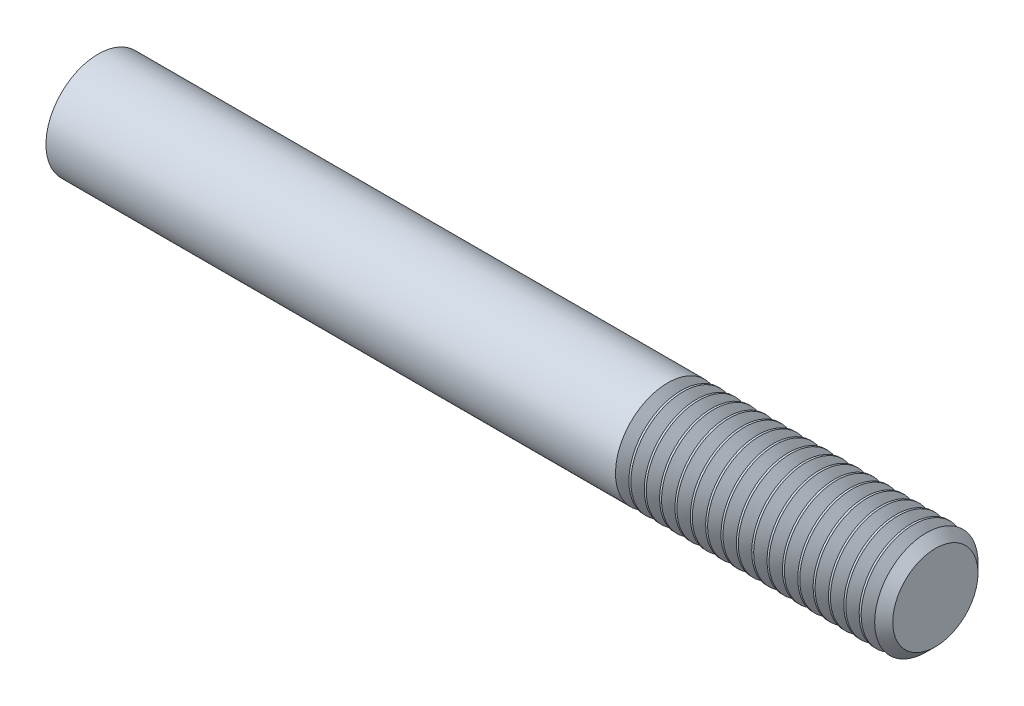
ISO-10303-21;
HEADER;
FILE_DESCRIPTION(('STEP AP214'),'2;1');
FILE_NAME('part.step','',(''),(''),'','','');
FILE_SCHEMA(('AUTOMOTIVE_DESIGN { 1 0 10303 214 1 1 1 1 }'));
ENDSEC;
DATA;
#1=APPLICATION_CONTEXT('core data for automotive mechanical design processes');
#2=APPLICATION_PROTOCOL_DEFINITION('international standard','automotive_design',2000,#1);
#3=PRODUCT_CONTEXT('',#1,'mechanical');
#4=PRODUCT('Part','Part','',(#3));
#5=PRODUCT_RELATED_PRODUCT_CATEGORY('part','',(#4));
#6=PRODUCT_DEFINITION_FORMATION('','',#4);
#7=PRODUCT_DEFINITION_CONTEXT('part definition',#1,'design');
#8=PRODUCT_DEFINITION('design','',#6,#7);
#9=PRODUCT_DEFINITION_SHAPE('','',#8);
#10=(LENGTH_UNIT() NAMED_UNIT(*) SI_UNIT(.MILLI.,.METRE.));
#11=(NAMED_UNIT(*) PLANE_ANGLE_UNIT() SI_UNIT($,.RADIAN.));
#12=(NAMED_UNIT(*) SI_UNIT($,.STERADIAN.) SOLID_ANGLE_UNIT());
#13=UNCERTAINTY_MEASURE_WITH_UNIT(LENGTH_MEASURE(1.E-05),#10,'distance_accuracy_value','');
#14=(GEOMETRIC_REPRESENTATION_CONTEXT(3) GLOBAL_UNCERTAINTY_ASSIGNED_CONTEXT((#13)) GLOBAL_UNIT_ASSIGNED_CONTEXT((#10,
#11,#12)) REPRESENTATION_CONTEXT('',''));
#15=CARTESIAN_POINT('',(0.,0.,0.));
#16=DIRECTION('',(0.,0.,1.));
#17=DIRECTION('',(1.,0.,0.));
#18=AXIS2_PLACEMENT_3D('',#15,#16,#17);
#19=CARTESIAN_POINT('',(0.,0.,0.));
#20=DIRECTION('',(-1.,0.,0.));
#21=DIRECTION('',(0.,0.,1.));
#22=AXIS2_PLACEMENT_3D('',#19,#20,#21);
#23=CYLINDRICAL_SURFACE('',#22,6.35);
#24=CARTESIAN_POINT('',(71.1570816254734,0.,0.));
#25=DIRECTION('',(-1.,0.,0.));
#26=DIRECTION('',(0.,-1.,0.));
#27=AXIS2_PLACEMENT_3D('',#24,#25,#26);
#28=CIRCLE('',#27,6.35000000000001);
#29=CARTESIAN_POINT('',(71.1570816254734,-6.35,0.));
#30=VERTEX_POINT('',#29);
#31=EDGE_CURVE('E217',#30,#30,#28,.T.);
#32=ORIENTED_EDGE('',*,*,#31,.T.);
#33=EDGE_LOOP('',(#32));
#34=FACE_BOUND('',#33,.T.);
#35=CARTESIAN_POINT('',(70.9185654333501,0.,0.));
#36=DIRECTION('',(-1.,0.,0.));
#37=DIRECTION('',(0.,-1.,0.));
#38=AXIS2_PLACEMENT_3D('',#35,#36,#37);
#39=CIRCLE('',#38,6.35000000000001);
#40=CARTESIAN_POINT('',(70.9185654333501,-6.35,0.));
#41=VERTEX_POINT('',#40);
#42=EDGE_CURVE('E229',#41,#41,#39,.T.);
#43=ORIENTED_EDGE('',*,*,#42,.F.);
#44=EDGE_LOOP('',(#43));
#45=FACE_BOUND('',#44,.T.);
#46=ADVANCED_FACE('F36',(#34,#45),#23,.T.);
#47=CARTESIAN_POINT('',(70.9185654333501,0.,0.));
#48=DIRECTION('',(1.,0.,0.));
#49=DIRECTION('',(0.,1.,0.));
#50=AXIS2_PLACEMENT_3D('',#47,#48,#49);
#51=CONICAL_SURFACE('',#50,6.35000000000001,0.959931088596887);
#52=CARTESIAN_POINT('',(70.104,0.,0.));
#53=DIRECTION('',(-1.,0.,0.));
#54=DIRECTION('',(0.,-1.,0.));
#55=AXIS2_PLACEMENT_3D('',#52,#53,#54);
#56=CIRCLE('',#55,5.18668000000001);
#57=CARTESIAN_POINT('',(70.104,-5.18668,0.));
#58=VERTEX_POINT('',#57);
#59=EDGE_CURVE('E223',#58,#58,#56,.T.);
#60=ORIENTED_EDGE('',*,*,#59,.F.);
#61=EDGE_LOOP('',(#60));
#62=FACE_BOUND('',#61,.T.);
#63=ORIENTED_EDGE('',*,*,#42,.T.);
#64=EDGE_LOOP('',(#63));
#65=FACE_BOUND('',#64,.T.);
#66=ADVANCED_FACE('F252',(#62,#65),#51,.T.);
#67=CARTESIAN_POINT('',(70.104,0.,0.));
#68=DIRECTION('',(-1.,0.,0.));
#69=DIRECTION('',(0.,-1.,0.));
#70=AXIS2_PLACEMENT_3D('',#67,#68,#69);
#71=CONICAL_SURFACE('',#70,5.18668000000001,0.959931088596879);
#72=CARTESIAN_POINT('',(69.2894345666499,0.,0.));
#73=DIRECTION('',(-1.,0.,0.));
#74=DIRECTION('',(0.,-1.,0.));
#75=AXIS2_PLACEMENT_3D('',#72,#73,#74);
#76=CIRCLE('',#75,6.35000000000001);
#77=CARTESIAN_POINT('',(69.2894345666499,-6.35,0.));
#78=VERTEX_POINT('',#77);
#79=EDGE_CURVE('E226',#78,#78,#76,.T.);
#80=ORIENTED_EDGE('',*,*,#79,.F.);
#81=EDGE_LOOP('',(#80));
#82=FACE_BOUND('',#81,.T.);
#83=ORIENTED_EDGE('',*,*,#59,.T.);
#84=EDGE_LOOP('',(#83));
#85=FACE_BOUND('',#84,.T.);
#86=ADVANCED_FACE('F259',(#82,#85),#71,.T.);
#87=CARTESIAN_POINT('',(0.,7.33234841870826,0.));
#88=DIRECTION('',(1.,0.,0.));
#89=DIRECTION('',(0.,0.,-1.));
#90=AXIS2_PLACEMENT_3D('',#87,#88,#89);
#91=PLANE('',#90);
#92=DIRECTION('',(0.,0.,-1.));
#93=VECTOR('',#92,1.);
#94=CARTESIAN_POINT('',(0.,2.54,-1.905));
#95=LINE('',#94,#93);
#96=CARTESIAN_POINT('',(0.,2.54,1.905));
#97=VERTEX_POINT('',#96);
#98=CARTESIAN_POINT('',(0.,2.54,-1.905));
#99=VERTEX_POINT('',#98);
#100=EDGE_CURVE('E72',#97,#99,#95,.T.);
#101=ORIENTED_EDGE('',*,*,#100,.F.);
#102=CARTESIAN_POINT('',(0.,0.,0.));
#103=DIRECTION('',(-1.,0.,0.));
#104=DIRECTION('',(0.,0.,1.));
#105=AXIS2_PLACEMENT_3D('',#102,#103,#104);
#106=CIRCLE('',#105,3.175);
#107=EDGE_CURVE('E52',#99,#97,#106,.T.);
#108=ORIENTED_EDGE('',*,*,#107,.F.);
#109=EDGE_LOOP('',(#101,#108));
#110=FACE_BOUND('',#109,.T.);
#111=CARTESIAN_POINT('',(0.,0.,0.));
#112=DIRECTION('',(1.,0.,0.));
#113=DIRECTION('',(0.,0.,-1.));
#114=AXIS2_PLACEMENT_3D('',#111,#112,#113);
#115=CIRCLE('',#114,6.35);
#116=CARTESIAN_POINT('',(0.,0.,-6.35));
#117=VERTEX_POINT('',#116);
#118=EDGE_CURVE('E12',#117,#117,#115,.T.);
#119=ORIENTED_EDGE('',*,*,#118,.F.);
#120=EDGE_LOOP('',(#119));
#121=FACE_BOUND('',#120,.T.);
#122=ADVANCED_FACE('F38',(#110,#121),#91,.F.);
#123=ORIENTED_EDGE('',*,*,#79,.T.);
#124=EDGE_LOOP('',(#123));
#125=FACE_BOUND('',#124,.T.);
#126=ORIENTED_EDGE('',*,*,#118,.T.);
#127=EDGE_LOOP('',(#126));
#128=FACE_BOUND('',#127,.T.);
#129=ADVANCED_FACE('F254',(#125,#128),#23,.T.);
#130=CARTESIAN_POINT('',(72.7862124921736,0.,0.));
#131=DIRECTION('',(1.,0.,0.));
#132=DIRECTION('',(0.,1.,0.));
#133=AXIS2_PLACEMENT_3D('',#130,#131,#132);
#134=CONICAL_SURFACE('',#133,6.35000000000001,0.959931088596887);
#135=CARTESIAN_POINT('',(71.9716470588235,0.,0.));
#136=DIRECTION('',(-1.,0.,0.));
#137=DIRECTION('',(0.,-1.,0.));
#138=AXIS2_PLACEMENT_3D('',#135,#136,#137);
#139=CIRCLE('',#138,5.18668000000001);
#140=CARTESIAN_POINT('',(71.9716470588235,-5.18668,0.));
#141=VERTEX_POINT('',#140);
#142=EDGE_CURVE('E214',#141,#141,#139,.T.);
#143=ORIENTED_EDGE('',*,*,#142,.F.);
#144=EDGE_LOOP('',(#143));
#145=FACE_BOUND('',#144,.T.);
#146=CARTESIAN_POINT('',(72.7862124921736,0.,0.));
#147=DIRECTION('',(-1.,0.,0.));
#148=DIRECTION('',(0.,-1.,0.));
#149=AXIS2_PLACEMENT_3D('',#146,#147,#148);
#150=CIRCLE('',#149,6.35000000000001);
#151=CARTESIAN_POINT('',(72.7862124921736,-6.35,0.));
#152=VERTEX_POINT('',#151);
#153=EDGE_CURVE('E220',#152,#152,#150,.T.);
#154=ORIENTED_EDGE('',*,*,#153,.T.);
#155=EDGE_LOOP('',(#154));
#156=FACE_BOUND('',#155,.T.);
#157=ADVANCED_FACE('F263',(#145,#156),#134,.T.);
#158=CARTESIAN_POINT('',(71.9716470588235,0.,0.));
#159=DIRECTION('',(-1.,0.,0.));
#160=DIRECTION('',(0.,-1.,0.));
#161=AXIS2_PLACEMENT_3D('',#158,#159,#160);
#162=CONICAL_SURFACE('',#161,5.18668000000001,0.959931088596879);
#163=ORIENTED_EDGE('',*,*,#31,.F.);
#164=EDGE_LOOP('',(#163));
#165=FACE_BOUND('',#164,.T.);
#166=ORIENTED_EDGE('',*,*,#142,.T.);
#167=EDGE_LOOP('',(#166));
#168=FACE_BOUND('',#167,.T.);
#169=ADVANCED_FACE('F268',(#165,#168),#162,.T.);
#170=CARTESIAN_POINT('',(73.0247286842969,0.,0.));
#171=DIRECTION('',(-1.,0.,0.));
#172=DIRECTION('',(0.,-1.,0.));
#173=AXIS2_PLACEMENT_3D('',#170,#171,#172);
#174=CIRCLE('',#173,6.35000000000001);
#175=CARTESIAN_POINT('',(73.0247286842969,-6.35,0.));
#176=VERTEX_POINT('',#175);
#177=EDGE_CURVE('E208',#176,#176,#174,.T.);
#178=ORIENTED_EDGE('',*,*,#177,.T.);
#179=EDGE_LOOP('',(#178));
#180=FACE_BOUND('',#179,.T.);
#181=ORIENTED_EDGE('',*,*,#153,.F.);
#182=EDGE_LOOP('',(#181));
#183=FACE_BOUND('',#182,.T.);
#184=ADVANCED_FACE('F255',(#180,#183),#23,.T.);
#185=CARTESIAN_POINT('',(74.6538595509972,0.,0.));
#186=DIRECTION('',(1.,0.,0.));
#187=DIRECTION('',(0.,1.,0.));
#188=AXIS2_PLACEMENT_3D('',#185,#186,#187);
#189=CONICAL_SURFACE('',#188,6.35000000000001,0.959931088596887);
#190=CARTESIAN_POINT('',(73.839294117647,0.,0.));
#191=DIRECTION('',(-1.,0.,0.));
#192=DIRECTION('',(0.,-1.,0.));
#193=AXIS2_PLACEMENT_3D('',#190,#191,#192);
#194=CIRCLE('',#193,5.18668000000001);
#195=CARTESIAN_POINT('',(73.839294117647,-5.18668,0.));
#196=VERTEX_POINT('',#195);
#197=EDGE_CURVE('E205',#196,#196,#194,.T.);
#198=ORIENTED_EDGE('',*,*,#197,.F.);
#199=EDGE_LOOP('',(#198));
#200=FACE_BOUND('',#199,.T.);
#201=CARTESIAN_POINT('',(74.6538595509972,0.,0.));
#202=DIRECTION('',(-1.,0.,0.));
#203=DIRECTION('',(0.,-1.,0.));
#204=AXIS2_PLACEMENT_3D('',#201,#202,#203);
#205=CIRCLE('',#204,6.35000000000001);
#206=CARTESIAN_POINT('',(74.6538595509972,-6.35,0.));
#207=VERTEX_POINT('',#206);
#208=EDGE_CURVE('E211',#207,#207,#205,.T.);
#209=ORIENTED_EDGE('',*,*,#208,.T.);
#210=EDGE_LOOP('',(#209));
#211=FACE_BOUND('',#210,.T.);
#212=ADVANCED_FACE('F267',(#200,#211),#189,.T.);
#213=CARTESIAN_POINT('',(73.839294117647,0.,0.));
#214=DIRECTION('',(-1.,0.,0.));
#215=DIRECTION('',(0.,-1.,0.));
#216=AXIS2_PLACEMENT_3D('',#213,#214,#215);
#217=CONICAL_SURFACE('',#216,5.18668000000001,0.959931088596879);
#218=ORIENTED_EDGE('',*,*,#177,.F.);
#219=EDGE_LOOP('',(#218));
#220=FACE_BOUND('',#219,.T.);
#221=ORIENTED_EDGE('',*,*,#197,.T.);
#222=EDGE_LOOP('',(#221));
#223=FACE_BOUND('',#222,.T.);
#224=ADVANCED_FACE('F275',(#220,#223),#217,.T.);
#225=CARTESIAN_POINT('',(74.8923757431205,0.,0.));
#226=DIRECTION('',(-1.,0.,0.));
#227=DIRECTION('',(0.,-1.,0.));
#228=AXIS2_PLACEMENT_3D('',#225,#226,#227);
#229=CIRCLE('',#228,6.35000000000001);
#230=CARTESIAN_POINT('',(74.8923757431205,-6.35,0.));
#231=VERTEX_POINT('',#230);
#232=EDGE_CURVE('E199',#231,#231,#229,.T.);
#233=ORIENTED_EDGE('',*,*,#232,.T.);
#234=EDGE_LOOP('',(#233));
#235=FACE_BOUND('',#234,.T.);
#236=ORIENTED_EDGE('',*,*,#208,.F.);
#237=EDGE_LOOP('',(#236));
#238=FACE_BOUND('',#237,.T.);
#239=ADVANCED_FACE('F270',(#235,#238),#23,.T.);
#240=CARTESIAN_POINT('',(76.5215066098207,0.,0.));
#241=DIRECTION('',(1.,0.,0.));
#242=DIRECTION('',(0.,1.,0.));
#243=AXIS2_PLACEMENT_3D('',#240,#241,#242);
#244=CONICAL_SURFACE('',#243,6.35000000000001,0.959931088596887);
#245=CARTESIAN_POINT('',(75.7069411764706,0.,0.));
#246=DIRECTION('',(-1.,0.,0.));
#247=DIRECTION('',(0.,-1.,0.));
#248=AXIS2_PLACEMENT_3D('',#245,#246,#247);
#249=CIRCLE('',#248,5.18668000000001);
#250=CARTESIAN_POINT('',(75.7069411764706,-5.18668,0.));
#251=VERTEX_POINT('',#250);
#252=EDGE_CURVE('E196',#251,#251,#249,.T.);
#253=ORIENTED_EDGE('',*,*,#252,.F.);
#254=EDGE_LOOP('',(#253));
#255=FACE_BOUND('',#254,.T.);
#256=CARTESIAN_POINT('',(76.5215066098207,0.,0.));
#257=DIRECTION('',(-1.,0.,0.));
#258=DIRECTION('',(0.,-1.,0.));
#259=AXIS2_PLACEMENT_3D('',#256,#257,#258);
#260=CIRCLE('',#259,6.35000000000001);
#261=CARTESIAN_POINT('',(76.5215066098207,-6.35,0.));
#262=VERTEX_POINT('',#261);
#263=EDGE_CURVE('E202',#262,#262,#260,.T.);
#264=ORIENTED_EDGE('',*,*,#263,.T.);
#265=EDGE_LOOP('',(#264));
#266=FACE_BOUND('',#265,.T.);
#267=ADVANCED_FACE('F282',(#255,#266),#244,.T.);
#268=CARTESIAN_POINT('',(75.7069411764706,0.,0.));
#269=DIRECTION('',(-1.,0.,0.));
#270=DIRECTION('',(0.,-1.,0.));
#271=AXIS2_PLACEMENT_3D('',#268,#269,#270);
#272=CONICAL_SURFACE('',#271,5.18668000000001,0.959931088596879);
#273=ORIENTED_EDGE('',*,*,#232,.F.);
#274=EDGE_LOOP('',(#273));
#275=FACE_BOUND('',#274,.T.);
#276=ORIENTED_EDGE('',*,*,#252,.T.);
#277=EDGE_LOOP('',(#276));
#278=FACE_BOUND('',#277,.T.);
#279=ADVANCED_FACE('F289',(#275,#278),#272,.T.);
#280=CARTESIAN_POINT('',(76.760022801944,0.,0.));
#281=DIRECTION('',(-1.,0.,0.));
#282=DIRECTION('',(0.,-1.,0.));
#283=AXIS2_PLACEMENT_3D('',#280,#281,#282);
#284=CIRCLE('',#283,6.35000000000001);
#285=CARTESIAN_POINT('',(76.760022801944,-6.35,0.));
#286=VERTEX_POINT('',#285);
#287=EDGE_CURVE('E190',#286,#286,#284,.T.);
#288=ORIENTED_EDGE('',*,*,#287,.T.);
#289=EDGE_LOOP('',(#288));
#290=FACE_BOUND('',#289,.T.);
#291=ORIENTED_EDGE('',*,*,#263,.F.);
#292=EDGE_LOOP('',(#291));
#293=FACE_BOUND('',#292,.T.);
#294=ADVANCED_FACE('F284',(#290,#293),#23,.T.);
#295=CARTESIAN_POINT('',(78.3891536686442,0.,0.));
#296=DIRECTION('',(1.,0.,0.));
#297=DIRECTION('',(0.,1.,0.));
#298=AXIS2_PLACEMENT_3D('',#295,#296,#297);
#299=CONICAL_SURFACE('',#298,6.35000000000001,0.959931088596887);
#300=CARTESIAN_POINT('',(77.5745882352941,0.,0.));
#301=DIRECTION('',(-1.,0.,0.));
#302=DIRECTION('',(0.,-1.,0.));
#303=AXIS2_PLACEMENT_3D('',#300,#301,#302);
#304=CIRCLE('',#303,5.18668000000001);
#305=CARTESIAN_POINT('',(77.5745882352941,-5.18668,0.));
#306=VERTEX_POINT('',#305);
#307=EDGE_CURVE('E187',#306,#306,#304,.T.);
#308=ORIENTED_EDGE('',*,*,#307,.F.);
#309=EDGE_LOOP('',(#308));
#310=FACE_BOUND('',#309,.T.);
#311=CARTESIAN_POINT('',(78.3891536686442,0.,0.));
#312=DIRECTION('',(-1.,0.,0.));
#313=DIRECTION('',(0.,-1.,0.));
#314=AXIS2_PLACEMENT_3D('',#311,#312,#313);
#315=CIRCLE('',#314,6.35000000000001);
#316=CARTESIAN_POINT('',(78.3891536686442,-6.35,0.));
#317=VERTEX_POINT('',#316);
#318=EDGE_CURVE('E193',#317,#317,#315,.T.);
#319=ORIENTED_EDGE('',*,*,#318,.T.);
#320=EDGE_LOOP('',(#319));
#321=FACE_BOUND('',#320,.T.);
#322=ADVANCED_FACE('F296',(#310,#321),#299,.T.);
#323=CARTESIAN_POINT('',(77.5745882352941,0.,0.));
#324=DIRECTION('',(-1.,0.,0.));
#325=DIRECTION('',(0.,-1.,0.));
#326=AXIS2_PLACEMENT_3D('',#323,#324,#325);
#327=CONICAL_SURFACE('',#326,5.18668000000001,0.959931088596879);
#328=ORIENTED_EDGE('',*,*,#287,.F.);
#329=EDGE_LOOP('',(#328));
#330=FACE_BOUND('',#329,.T.);
#331=ORIENTED_EDGE('',*,*,#307,.T.);
#332=EDGE_LOOP('',(#331));
#333=FACE_BOUND('',#332,.T.);
#334=ADVANCED_FACE('F303',(#330,#333),#327,.T.);
#335=CARTESIAN_POINT('',(78.6276698607675,0.,0.));
#336=DIRECTION('',(-1.,0.,0.));
#337=DIRECTION('',(0.,-1.,0.));
#338=AXIS2_PLACEMENT_3D('',#335,#336,#337);
#339=CIRCLE('',#338,6.35000000000001);
#340=CARTESIAN_POINT('',(78.6276698607675,-6.35,0.));
#341=VERTEX_POINT('',#340);
#342=EDGE_CURVE('E181',#341,#341,#339,.T.);
#343=ORIENTED_EDGE('',*,*,#342,.T.);
#344=EDGE_LOOP('',(#343));
#345=FACE_BOUND('',#344,.T.);
#346=ORIENTED_EDGE('',*,*,#318,.F.);
#347=EDGE_LOOP('',(#346));
#348=FACE_BOUND('',#347,.T.);
#349=ADVANCED_FACE('F298',(#345,#348),#23,.T.);
#350=CARTESIAN_POINT('',(80.2568007274677,0.,0.));
#351=DIRECTION('',(1.,0.,0.));
#352=DIRECTION('',(0.,1.,0.));
#353=AXIS2_PLACEMENT_3D('',#350,#351,#352);
#354=CONICAL_SURFACE('',#353,6.35000000000001,0.959931088596887);
#355=CARTESIAN_POINT('',(79.4422352941176,0.,0.));
#356=DIRECTION('',(-1.,0.,0.));
#357=DIRECTION('',(0.,-1.,0.));
#358=AXIS2_PLACEMENT_3D('',#355,#356,#357);
#359=CIRCLE('',#358,5.18668000000001);
#360=CARTESIAN_POINT('',(79.4422352941176,-5.18668,0.));
#361=VERTEX_POINT('',#360);
#362=EDGE_CURVE('E178',#361,#361,#359,.T.);
#363=ORIENTED_EDGE('',*,*,#362,.F.);
#364=EDGE_LOOP('',(#363));
#365=FACE_BOUND('',#364,.T.);
#366=CARTESIAN_POINT('',(80.2568007274677,0.,0.));
#367=DIRECTION('',(-1.,0.,0.));
#368=DIRECTION('',(0.,-1.,0.));
#369=AXIS2_PLACEMENT_3D('',#366,#367,#368);
#370=CIRCLE('',#369,6.35000000000001);
#371=CARTESIAN_POINT('',(80.2568007274677,-6.35,0.));
#372=VERTEX_POINT('',#371);
#373=EDGE_CURVE('E184',#372,#372,#370,.T.);
#374=ORIENTED_EDGE('',*,*,#373,.T.);
#375=EDGE_LOOP('',(#374));
#376=FACE_BOUND('',#375,.T.);
#377=ADVANCED_FACE('F310',(#365,#376),#354,.T.);
#378=CARTESIAN_POINT('',(79.4422352941176,0.,0.));
#379=DIRECTION('',(-1.,0.,0.));
#380=DIRECTION('',(0.,-1.,0.));
#381=AXIS2_PLACEMENT_3D('',#378,#379,#380);
#382=CONICAL_SURFACE('',#381,5.18668000000001,0.959931088596879);
#383=ORIENTED_EDGE('',*,*,#342,.F.);
#384=EDGE_LOOP('',(#383));
#385=FACE_BOUND('',#384,.T.);
#386=ORIENTED_EDGE('',*,*,#362,.T.);
#387=EDGE_LOOP('',(#386));
#388=FACE_BOUND('',#387,.T.);
#389=ADVANCED_FACE('F317',(#385,#388),#382,.T.);
#390=CARTESIAN_POINT('',(80.495316919591,0.,0.));
#391=DIRECTION('',(-1.,0.,0.));
#392=DIRECTION('',(0.,-1.,0.));
#393=AXIS2_PLACEMENT_3D('',#390,#391,#392);
#394=CIRCLE('',#393,6.35000000000001);
#395=CARTESIAN_POINT('',(80.495316919591,-6.35,0.));
#396=VERTEX_POINT('',#395);
#397=EDGE_CURVE('E172',#396,#396,#394,.T.);
#398=ORIENTED_EDGE('',*,*,#397,.T.);
#399=EDGE_LOOP('',(#398));
#400=FACE_BOUND('',#399,.T.);
#401=ORIENTED_EDGE('',*,*,#373,.F.);
#402=EDGE_LOOP('',(#401));
#403=FACE_BOUND('',#402,.T.);
#404=ADVANCED_FACE('F312',(#400,#403),#23,.T.);
#405=CARTESIAN_POINT('',(82.1244477862913,0.,0.));
#406=DIRECTION('',(1.,0.,0.));
#407=DIRECTION('',(0.,1.,0.));
#408=AXIS2_PLACEMENT_3D('',#405,#406,#407);
#409=CONICAL_SURFACE('',#408,6.35000000000001,0.959931088596887);
#410=CARTESIAN_POINT('',(81.3098823529412,0.,0.));
#411=DIRECTION('',(-1.,0.,0.));
#412=DIRECTION('',(0.,-1.,0.));
#413=AXIS2_PLACEMENT_3D('',#410,#411,#412);
#414=CIRCLE('',#413,5.18668000000001);
#415=CARTESIAN_POINT('',(81.3098823529412,-5.18668,0.));
#416=VERTEX_POINT('',#415);
#417=EDGE_CURVE('E169',#416,#416,#414,.T.);
#418=ORIENTED_EDGE('',*,*,#417,.F.);
#419=EDGE_LOOP('',(#418));
#420=FACE_BOUND('',#419,.T.);
#421=CARTESIAN_POINT('',(82.1244477862913,0.,0.));
#422=DIRECTION('',(-1.,0.,0.));
#423=DIRECTION('',(0.,-1.,0.));
#424=AXIS2_PLACEMENT_3D('',#421,#422,#423);
#425=CIRCLE('',#424,6.35000000000001);
#426=CARTESIAN_POINT('',(82.1244477862913,-6.35,0.));
#427=VERTEX_POINT('',#426);
#428=EDGE_CURVE('E175',#427,#427,#425,.T.);
#429=ORIENTED_EDGE('',*,*,#428,.T.);
#430=EDGE_LOOP('',(#429));
#431=FACE_BOUND('',#430,.T.);
#432=ADVANCED_FACE('F324',(#420,#431),#409,.T.);
#433=CARTESIAN_POINT('',(81.3098823529412,0.,0.));
#434=DIRECTION('',(-1.,0.,0.));
#435=DIRECTION('',(0.,-1.,0.));
#436=AXIS2_PLACEMENT_3D('',#433,#434,#435);
#437=CONICAL_SURFACE('',#436,5.18668000000001,0.959931088596879);
#438=ORIENTED_EDGE('',*,*,#397,.F.);
#439=EDGE_LOOP('',(#438));
#440=FACE_BOUND('',#439,.T.);
#441=ORIENTED_EDGE('',*,*,#417,.T.);
#442=EDGE_LOOP('',(#441));
#443=FACE_BOUND('',#442,.T.);
#444=ADVANCED_FACE('F331',(#440,#443),#437,.T.);
#445=CARTESIAN_POINT('',(82.3629639784146,0.,0.));
#446=DIRECTION('',(-1.,0.,0.));
#447=DIRECTION('',(0.,-1.,0.));
#448=AXIS2_PLACEMENT_3D('',#445,#446,#447);
#449=CIRCLE('',#448,6.35000000000001);
#450=CARTESIAN_POINT('',(82.3629639784146,-6.35,0.));
#451=VERTEX_POINT('',#450);
#452=EDGE_CURVE('E163',#451,#451,#449,.T.);
#453=ORIENTED_EDGE('',*,*,#452,.T.);
#454=EDGE_LOOP('',(#453));
#455=FACE_BOUND('',#454,.T.);
#456=ORIENTED_EDGE('',*,*,#428,.F.);
#457=EDGE_LOOP('',(#456));
#458=FACE_BOUND('',#457,.T.);
#459=ADVANCED_FACE('F326',(#455,#458),#23,.T.);
#460=CARTESIAN_POINT('',(83.9920948451148,0.,0.));
#461=DIRECTION('',(1.,0.,0.));
#462=DIRECTION('',(0.,1.,0.));
#463=AXIS2_PLACEMENT_3D('',#460,#461,#462);
#464=CONICAL_SURFACE('',#463,6.35000000000001,0.959931088596887);
#465=CARTESIAN_POINT('',(83.1775294117647,0.,0.));
#466=DIRECTION('',(-1.,0.,0.));
#467=DIRECTION('',(0.,-1.,0.));
#468=AXIS2_PLACEMENT_3D('',#465,#466,#467);
#469=CIRCLE('',#468,5.18668000000001);
#470=CARTESIAN_POINT('',(83.1775294117647,-5.18668,0.));
#471=VERTEX_POINT('',#470);
#472=EDGE_CURVE('E160',#471,#471,#469,.T.);
#473=ORIENTED_EDGE('',*,*,#472,.F.);
#474=EDGE_LOOP('',(#473));
#475=FACE_BOUND('',#474,.T.);
#476=CARTESIAN_POINT('',(83.9920948451148,0.,0.));
#477=DIRECTION('',(-1.,0.,0.));
#478=DIRECTION('',(0.,-1.,0.));
#479=AXIS2_PLACEMENT_3D('',#476,#477,#478);
#480=CIRCLE('',#479,6.35000000000001);
#481=CARTESIAN_POINT('',(83.9920948451148,-6.35,0.));
#482=VERTEX_POINT('',#481);
#483=EDGE_CURVE('E166',#482,#482,#480,.T.);
#484=ORIENTED_EDGE('',*,*,#483,.T.);
#485=EDGE_LOOP('',(#484));
#486=FACE_BOUND('',#485,.T.);
#487=ADVANCED_FACE('F338',(#475,#486),#464,.T.);
#488=CARTESIAN_POINT('',(83.1775294117647,0.,0.));
#489=DIRECTION('',(-1.,0.,0.));
#490=DIRECTION('',(0.,-1.,0.));
#491=AXIS2_PLACEMENT_3D('',#488,#489,#490);
#492=CONICAL_SURFACE('',#491,5.18668000000001,0.959931088596879);
#493=ORIENTED_EDGE('',*,*,#452,.F.);
#494=EDGE_LOOP('',(#493));
#495=FACE_BOUND('',#494,.T.);
#496=ORIENTED_EDGE('',*,*,#472,.T.);
#497=EDGE_LOOP('',(#496));
#498=FACE_BOUND('',#497,.T.);
#499=ADVANCED_FACE('F345',(#495,#498),#492,.T.);
#500=CARTESIAN_POINT('',(84.2306110372381,0.,0.));
#501=DIRECTION('',(-1.,0.,0.));
#502=DIRECTION('',(0.,-1.,0.));
#503=AXIS2_PLACEMENT_3D('',#500,#501,#502);
#504=CIRCLE('',#503,6.35000000000001);
#505=CARTESIAN_POINT('',(84.2306110372381,-6.35,0.));
#506=VERTEX_POINT('',#505);
#507=EDGE_CURVE('E154',#506,#506,#504,.T.);
#508=ORIENTED_EDGE('',*,*,#507,.T.);
#509=EDGE_LOOP('',(#508));
#510=FACE_BOUND('',#509,.T.);
#511=ORIENTED_EDGE('',*,*,#483,.F.);
#512=EDGE_LOOP('',(#511));
#513=FACE_BOUND('',#512,.T.);
#514=ADVANCED_FACE('F340',(#510,#513),#23,.T.);
#515=CARTESIAN_POINT('',(85.8597419039383,0.,0.));
#516=DIRECTION('',(1.,0.,0.));
#517=DIRECTION('',(0.,1.,0.));
#518=AXIS2_PLACEMENT_3D('',#515,#516,#517);
#519=CONICAL_SURFACE('',#518,6.35000000000001,0.959931088596887);
#520=CARTESIAN_POINT('',(85.0451764705882,0.,0.));
#521=DIRECTION('',(-1.,0.,0.));
#522=DIRECTION('',(0.,-1.,0.));
#523=AXIS2_PLACEMENT_3D('',#520,#521,#522);
#524=CIRCLE('',#523,5.18668000000001);
#525=CARTESIAN_POINT('',(85.0451764705882,-5.18668,0.));
#526=VERTEX_POINT('',#525);
#527=EDGE_CURVE('E151',#526,#526,#524,.T.);
#528=ORIENTED_EDGE('',*,*,#527,.F.);
#529=EDGE_LOOP('',(#528));
#530=FACE_BOUND('',#529,.T.);
#531=CARTESIAN_POINT('',(85.8597419039383,0.,0.));
#532=DIRECTION('',(-1.,0.,0.));
#533=DIRECTION('',(0.,-1.,0.));
#534=AXIS2_PLACEMENT_3D('',#531,#532,#533);
#535=CIRCLE('',#534,6.35000000000001);
#536=CARTESIAN_POINT('',(85.8597419039383,-6.35,0.));
#537=VERTEX_POINT('',#536);
#538=EDGE_CURVE('E157',#537,#537,#535,.T.);
#539=ORIENTED_EDGE('',*,*,#538,.T.);
#540=EDGE_LOOP('',(#539));
#541=FACE_BOUND('',#540,.T.);
#542=ADVANCED_FACE('F352',(#530,#541),#519,.T.);
#543=CARTESIAN_POINT('',(85.0451764705882,0.,0.));
#544=DIRECTION('',(-1.,0.,0.));
#545=DIRECTION('',(0.,-1.,0.));
#546=AXIS2_PLACEMENT_3D('',#543,#544,#545);
#547=CONICAL_SURFACE('',#546,5.18668000000001,0.959931088596879);
#548=ORIENTED_EDGE('',*,*,#507,.F.);
#549=EDGE_LOOP('',(#548));
#550=FACE_BOUND('',#549,.T.);
#551=ORIENTED_EDGE('',*,*,#527,.T.);
#552=EDGE_LOOP('',(#551));
#553=FACE_BOUND('',#552,.T.);
#554=ADVANCED_FACE('F359',(#550,#553),#547,.T.);
#555=CARTESIAN_POINT('',(86.0982580960616,0.,0.));
#556=DIRECTION('',(-1.,0.,0.));
#557=DIRECTION('',(0.,-1.,0.));
#558=AXIS2_PLACEMENT_3D('',#555,#556,#557);
#559=CIRCLE('',#558,6.35000000000001);
#560=CARTESIAN_POINT('',(86.0982580960616,-6.35,0.));
#561=VERTEX_POINT('',#560);
#562=EDGE_CURVE('E145',#561,#561,#559,.T.);
#563=ORIENTED_EDGE('',*,*,#562,.T.);
#564=EDGE_LOOP('',(#563));
#565=FACE_BOUND('',#564,.T.);
#566=ORIENTED_EDGE('',*,*,#538,.F.);
#567=EDGE_LOOP('',(#566));
#568=FACE_BOUND('',#567,.T.);
#569=ADVANCED_FACE('F354',(#565,#568),#23,.T.);
#570=CARTESIAN_POINT('',(87.7273889627619,0.,0.));
#571=DIRECTION('',(1.,0.,0.));
#572=DIRECTION('',(0.,1.,0.));
#573=AXIS2_PLACEMENT_3D('',#570,#571,#572);
#574=CONICAL_SURFACE('',#573,6.35000000000001,0.959931088596887);
#575=CARTESIAN_POINT('',(86.9128235294118,0.,0.));
#576=DIRECTION('',(-1.,0.,0.));
#577=DIRECTION('',(0.,-1.,0.));
#578=AXIS2_PLACEMENT_3D('',#575,#576,#577);
#579=CIRCLE('',#578,5.18668000000001);
#580=CARTESIAN_POINT('',(86.9128235294118,-5.18668,0.));
#581=VERTEX_POINT('',#580);
#582=EDGE_CURVE('E142',#581,#581,#579,.T.);
#583=ORIENTED_EDGE('',*,*,#582,.F.);
#584=EDGE_LOOP('',(#583));
#585=FACE_BOUND('',#584,.T.);
#586=CARTESIAN_POINT('',(87.7273889627619,0.,0.));
#587=DIRECTION('',(-1.,0.,0.));
#588=DIRECTION('',(0.,-1.,0.));
#589=AXIS2_PLACEMENT_3D('',#586,#587,#588);
#590=CIRCLE('',#589,6.35000000000001);
#591=CARTESIAN_POINT('',(87.7273889627619,-6.35,0.));
#592=VERTEX_POINT('',#591);
#593=EDGE_CURVE('E148',#592,#592,#590,.T.);
#594=ORIENTED_EDGE('',*,*,#593,.T.);
#595=EDGE_LOOP('',(#594));
#596=FACE_BOUND('',#595,.T.);
#597=ADVANCED_FACE('F366',(#585,#596),#574,.T.);
#598=CARTESIAN_POINT('',(86.9128235294118,0.,0.));
#599=DIRECTION('',(-1.,0.,0.));
#600=DIRECTION('',(0.,-1.,0.));
#601=AXIS2_PLACEMENT_3D('',#598,#599,#600);
#602=CONICAL_SURFACE('',#601,5.18668000000001,0.959931088596879);
#603=ORIENTED_EDGE('',*,*,#562,.F.);
#604=EDGE_LOOP('',(#603));
#605=FACE_BOUND('',#604,.T.);
#606=ORIENTED_EDGE('',*,*,#582,.T.);
#607=EDGE_LOOP('',(#606));
#608=FACE_BOUND('',#607,.T.);
#609=ADVANCED_FACE('F373',(#605,#608),#602,.T.);
#610=CARTESIAN_POINT('',(87.9659051548852,0.,0.));
#611=DIRECTION('',(-1.,0.,0.));
#612=DIRECTION('',(0.,-1.,0.));
#613=AXIS2_PLACEMENT_3D('',#610,#611,#612);
#614=CIRCLE('',#613,6.35000000000001);
#615=CARTESIAN_POINT('',(87.9659051548852,-6.35,0.));
#616=VERTEX_POINT('',#615);
#617=EDGE_CURVE('E136',#616,#616,#614,.T.);
#618=ORIENTED_EDGE('',*,*,#617,.T.);
#619=EDGE_LOOP('',(#618));
#620=FACE_BOUND('',#619,.T.);
#621=ORIENTED_EDGE('',*,*,#593,.F.);
#622=EDGE_LOOP('',(#621));
#623=FACE_BOUND('',#622,.T.);
#624=ADVANCED_FACE('F368',(#620,#623),#23,.T.);
#625=CARTESIAN_POINT('',(89.5950360215854,0.,0.));
#626=DIRECTION('',(1.,0.,0.));
#627=DIRECTION('',(0.,1.,0.));
#628=AXIS2_PLACEMENT_3D('',#625,#626,#627);
#629=CONICAL_SURFACE('',#628,6.35000000000001,0.959931088596887);
#630=CARTESIAN_POINT('',(88.7804705882353,0.,0.));
#631=DIRECTION('',(-1.,0.,0.));
#632=DIRECTION('',(0.,-1.,0.));
#633=AXIS2_PLACEMENT_3D('',#630,#631,#632);
#634=CIRCLE('',#633,5.18668000000001);
#635=CARTESIAN_POINT('',(88.7804705882353,-5.18668,0.));
#636=VERTEX_POINT('',#635);
#637=EDGE_CURVE('E133',#636,#636,#634,.T.);
#638=ORIENTED_EDGE('',*,*,#637,.F.);
#639=EDGE_LOOP('',(#638));
#640=FACE_BOUND('',#639,.T.);
#641=CARTESIAN_POINT('',(89.5950360215854,0.,0.));
#642=DIRECTION('',(-1.,0.,0.));
#643=DIRECTION('',(0.,-1.,0.));
#644=AXIS2_PLACEMENT_3D('',#641,#642,#643);
#645=CIRCLE('',#644,6.35000000000001);
#646=CARTESIAN_POINT('',(89.5950360215854,-6.35,0.));
#647=VERTEX_POINT('',#646);
#648=EDGE_CURVE('E139',#647,#647,#645,.T.);
#649=ORIENTED_EDGE('',*,*,#648,.T.);
#650=EDGE_LOOP('',(#649));
#651=FACE_BOUND('',#650,.T.);
#652=ADVANCED_FACE('F380',(#640,#651),#629,.T.);
#653=CARTESIAN_POINT('',(88.7804705882353,0.,0.));
#654=DIRECTION('',(-1.,0.,0.));
#655=DIRECTION('',(0.,-1.,0.));
#656=AXIS2_PLACEMENT_3D('',#653,#654,#655);
#657=CONICAL_SURFACE('',#656,5.18668000000001,0.959931088596879);
#658=ORIENTED_EDGE('',*,*,#617,.F.);
#659=EDGE_LOOP('',(#658));
#660=FACE_BOUND('',#659,.T.);
#661=ORIENTED_EDGE('',*,*,#637,.T.);
#662=EDGE_LOOP('',(#661));
#663=FACE_BOUND('',#662,.T.);
#664=ADVANCED_FACE('F387',(#660,#663),#657,.T.);
#665=CARTESIAN_POINT('',(89.8335522137087,0.,0.));
#666=DIRECTION('',(-1.,0.,0.));
#667=DIRECTION('',(0.,-1.,0.));
#668=AXIS2_PLACEMENT_3D('',#665,#666,#667);
#669=CIRCLE('',#668,6.35000000000001);
#670=CARTESIAN_POINT('',(89.8335522137087,-6.35,0.));
#671=VERTEX_POINT('',#670);
#672=EDGE_CURVE('E127',#671,#671,#669,.T.);
#673=ORIENTED_EDGE('',*,*,#672,.T.);
#674=EDGE_LOOP('',(#673));
#675=FACE_BOUND('',#674,.T.);
#676=ORIENTED_EDGE('',*,*,#648,.F.);
#677=EDGE_LOOP('',(#676));
#678=FACE_BOUND('',#677,.T.);
#679=ADVANCED_FACE('F382',(#675,#678),#23,.T.);
#680=CARTESIAN_POINT('',(91.4626830804089,0.,0.));
#681=DIRECTION('',(1.,0.,0.));
#682=DIRECTION('',(0.,1.,0.));
#683=AXIS2_PLACEMENT_3D('',#680,#681,#682);
#684=CONICAL_SURFACE('',#683,6.35000000000001,0.959931088596887);
#685=CARTESIAN_POINT('',(90.6481176470588,0.,0.));
#686=DIRECTION('',(-1.,0.,0.));
#687=DIRECTION('',(0.,-1.,0.));
#688=AXIS2_PLACEMENT_3D('',#685,#686,#687);
#689=CIRCLE('',#688,5.18668000000001);
#690=CARTESIAN_POINT('',(90.6481176470588,-5.18668,0.));
#691=VERTEX_POINT('',#690);
#692=EDGE_CURVE('E124',#691,#691,#689,.T.);
#693=ORIENTED_EDGE('',*,*,#692,.F.);
#694=EDGE_LOOP('',(#693));
#695=FACE_BOUND('',#694,.T.);
#696=CARTESIAN_POINT('',(91.4626830804089,0.,0.));
#697=DIRECTION('',(-1.,0.,0.));
#698=DIRECTION('',(0.,-1.,0.));
#699=AXIS2_PLACEMENT_3D('',#696,#697,#698);
#700=CIRCLE('',#699,6.35000000000001);
#701=CARTESIAN_POINT('',(91.4626830804089,-6.35,0.));
#702=VERTEX_POINT('',#701);
#703=EDGE_CURVE('E130',#702,#702,#700,.T.);
#704=ORIENTED_EDGE('',*,*,#703,.T.);
#705=EDGE_LOOP('',(#704));
#706=FACE_BOUND('',#705,.T.);
#707=ADVANCED_FACE('F394',(#695,#706),#684,.T.);
#708=CARTESIAN_POINT('',(90.6481176470588,0.,0.));
#709=DIRECTION('',(-1.,0.,0.));
#710=DIRECTION('',(0.,-1.,0.));
#711=AXIS2_PLACEMENT_3D('',#708,#709,#710);
#712=CONICAL_SURFACE('',#711,5.18668000000001,0.959931088596879);
#713=ORIENTED_EDGE('',*,*,#672,.F.);
#714=EDGE_LOOP('',(#713));
#715=FACE_BOUND('',#714,.T.);
#716=ORIENTED_EDGE('',*,*,#692,.T.);
#717=EDGE_LOOP('',(#716));
#718=FACE_BOUND('',#717,.T.);
#719=ADVANCED_FACE('F401',(#715,#718),#712,.T.);
#720=CARTESIAN_POINT('',(91.7011992725322,0.,0.));
#721=DIRECTION('',(-1.,0.,0.));
#722=DIRECTION('',(0.,-1.,0.));
#723=AXIS2_PLACEMENT_3D('',#720,#721,#722);
#724=CIRCLE('',#723,6.35000000000001);
#725=CARTESIAN_POINT('',(91.7011992725322,-6.35,0.));
#726=VERTEX_POINT('',#725);
#727=EDGE_CURVE('E118',#726,#726,#724,.T.);
#728=ORIENTED_EDGE('',*,*,#727,.T.);
#729=EDGE_LOOP('',(#728));
#730=FACE_BOUND('',#729,.T.);
#731=ORIENTED_EDGE('',*,*,#703,.F.);
#732=EDGE_LOOP('',(#731));
#733=FACE_BOUND('',#732,.T.);
#734=ADVANCED_FACE('F396',(#730,#733),#23,.T.);
#735=CARTESIAN_POINT('',(93.3303301392324,0.,0.));
#736=DIRECTION('',(1.,0.,0.));
#737=DIRECTION('',(0.,1.,0.));
#738=AXIS2_PLACEMENT_3D('',#735,#736,#737);
#739=CONICAL_SURFACE('',#738,6.35000000000001,0.959931088596887);
#740=CARTESIAN_POINT('',(92.5157647058823,0.,0.));
#741=DIRECTION('',(-1.,0.,0.));
#742=DIRECTION('',(0.,-1.,0.));
#743=AXIS2_PLACEMENT_3D('',#740,#741,#742);
#744=CIRCLE('',#743,5.18668000000001);
#745=CARTESIAN_POINT('',(92.5157647058823,-5.18668,0.));
#746=VERTEX_POINT('',#745);
#747=EDGE_CURVE('E115',#746,#746,#744,.T.);
#748=ORIENTED_EDGE('',*,*,#747,.F.);
#749=EDGE_LOOP('',(#748));
#750=FACE_BOUND('',#749,.T.);
#751=CARTESIAN_POINT('',(93.3303301392324,0.,0.));
#752=DIRECTION('',(-1.,0.,0.));
#753=DIRECTION('',(0.,-1.,0.));
#754=AXIS2_PLACEMENT_3D('',#751,#752,#753);
#755=CIRCLE('',#754,6.35000000000001);
#756=CARTESIAN_POINT('',(93.3303301392324,-6.35,0.));
#757=VERTEX_POINT('',#756);
#758=EDGE_CURVE('E121',#757,#757,#755,.T.);
#759=ORIENTED_EDGE('',*,*,#758,.T.);
#760=EDGE_LOOP('',(#759));
#761=FACE_BOUND('',#760,.T.);
#762=ADVANCED_FACE('F408',(#750,#761),#739,.T.);
#763=CARTESIAN_POINT('',(92.5157647058823,0.,0.));
#764=DIRECTION('',(-1.,0.,0.));
#765=DIRECTION('',(0.,-1.,0.));
#766=AXIS2_PLACEMENT_3D('',#763,#764,#765);
#767=CONICAL_SURFACE('',#766,5.18668000000001,0.959931088596879);
#768=ORIENTED_EDGE('',*,*,#727,.F.);
#769=EDGE_LOOP('',(#768));
#770=FACE_BOUND('',#769,.T.);
#771=ORIENTED_EDGE('',*,*,#747,.T.);
#772=EDGE_LOOP('',(#771));
#773=FACE_BOUND('',#772,.T.);
#774=ADVANCED_FACE('F415',(#770,#773),#767,.T.);
#775=CARTESIAN_POINT('',(93.5688463313557,0.,0.));
#776=DIRECTION('',(-1.,0.,0.));
#777=DIRECTION('',(0.,-1.,0.));
#778=AXIS2_PLACEMENT_3D('',#775,#776,#777);
#779=CIRCLE('',#778,6.35000000000001);
#780=CARTESIAN_POINT('',(93.5688463313557,-6.35,0.));
#781=VERTEX_POINT('',#780);
#782=EDGE_CURVE('E109',#781,#781,#779,.T.);
#783=ORIENTED_EDGE('',*,*,#782,.T.);
#784=EDGE_LOOP('',(#783));
#785=FACE_BOUND('',#784,.T.);
#786=ORIENTED_EDGE('',*,*,#758,.F.);
#787=EDGE_LOOP('',(#786));
#788=FACE_BOUND('',#787,.T.);
#789=ADVANCED_FACE('F410',(#785,#788),#23,.T.);
#790=CARTESIAN_POINT('',(95.197977198056,0.,0.));
#791=DIRECTION('',(1.,0.,0.));
#792=DIRECTION('',(0.,1.,0.));
#793=AXIS2_PLACEMENT_3D('',#790,#791,#792);
#794=CONICAL_SURFACE('',#793,6.35000000000001,0.959931088596887);
#795=CARTESIAN_POINT('',(94.3834117647059,0.,0.));
#796=DIRECTION('',(-1.,0.,0.));
#797=DIRECTION('',(0.,-1.,0.));
#798=AXIS2_PLACEMENT_3D('',#795,#796,#797);
#799=CIRCLE('',#798,5.18668000000001);
#800=CARTESIAN_POINT('',(94.3834117647059,-5.18668,0.));
#801=VERTEX_POINT('',#800);
#802=EDGE_CURVE('E106',#801,#801,#799,.T.);
#803=ORIENTED_EDGE('',*,*,#802,.F.);
#804=EDGE_LOOP('',(#803));
#805=FACE_BOUND('',#804,.T.);
#806=CARTESIAN_POINT('',(95.197977198056,0.,0.));
#807=DIRECTION('',(-1.,0.,0.));
#808=DIRECTION('',(0.,-1.,0.));
#809=AXIS2_PLACEMENT_3D('',#806,#807,#808);
#810=CIRCLE('',#809,6.35000000000001);
#811=CARTESIAN_POINT('',(95.197977198056,-6.35,0.));
#812=VERTEX_POINT('',#811);
#813=EDGE_CURVE('E112',#812,#812,#810,.T.);
#814=ORIENTED_EDGE('',*,*,#813,.T.);
#815=EDGE_LOOP('',(#814));
#816=FACE_BOUND('',#815,.T.);
#817=ADVANCED_FACE('F422',(#805,#816),#794,.T.);
#818=CARTESIAN_POINT('',(94.3834117647059,0.,0.));
#819=DIRECTION('',(-1.,0.,0.));
#820=DIRECTION('',(0.,-1.,0.));
#821=AXIS2_PLACEMENT_3D('',#818,#819,#820);
#822=CONICAL_SURFACE('',#821,5.18668000000001,0.959931088596879);
#823=ORIENTED_EDGE('',*,*,#782,.F.);
#824=EDGE_LOOP('',(#823));
#825=FACE_BOUND('',#824,.T.);
#826=ORIENTED_EDGE('',*,*,#802,.T.);
#827=EDGE_LOOP('',(#826));
#828=FACE_BOUND('',#827,.T.);
#829=ADVANCED_FACE('F429',(#825,#828),#822,.T.);
#830=CARTESIAN_POINT('',(95.4364933901793,0.,0.));
#831=DIRECTION('',(-1.,0.,0.));
#832=DIRECTION('',(0.,-1.,0.));
#833=AXIS2_PLACEMENT_3D('',#830,#831,#832);
#834=CIRCLE('',#833,6.35000000000001);
#835=CARTESIAN_POINT('',(95.4364933901793,-6.35,0.));
#836=VERTEX_POINT('',#835);
#837=EDGE_CURVE('E100',#836,#836,#834,.T.);
#838=ORIENTED_EDGE('',*,*,#837,.T.);
#839=EDGE_LOOP('',(#838));
#840=FACE_BOUND('',#839,.T.);
#841=ORIENTED_EDGE('',*,*,#813,.F.);
#842=EDGE_LOOP('',(#841));
#843=FACE_BOUND('',#842,.T.);
#844=ADVANCED_FACE('F424',(#840,#843),#23,.T.);
#845=CARTESIAN_POINT('',(97.0656242568795,0.,0.));
#846=DIRECTION('',(1.,0.,0.));
#847=DIRECTION('',(0.,1.,0.));
#848=AXIS2_PLACEMENT_3D('',#845,#846,#847);
#849=CONICAL_SURFACE('',#848,6.35000000000001,0.959931088596887);
#850=CARTESIAN_POINT('',(96.2510588235294,0.,0.));
#851=DIRECTION('',(-1.,0.,0.));
#852=DIRECTION('',(0.,-1.,0.));
#853=AXIS2_PLACEMENT_3D('',#850,#851,#852);
#854=CIRCLE('',#853,5.18668000000001);
#855=CARTESIAN_POINT('',(96.2510588235294,-5.18668,0.));
#856=VERTEX_POINT('',#855);
#857=EDGE_CURVE('E97',#856,#856,#854,.T.);
#858=ORIENTED_EDGE('',*,*,#857,.F.);
#859=EDGE_LOOP('',(#858));
#860=FACE_BOUND('',#859,.T.);
#861=CARTESIAN_POINT('',(97.0656242568795,0.,0.));
#862=DIRECTION('',(-1.,0.,0.));
#863=DIRECTION('',(0.,-1.,0.));
#864=AXIS2_PLACEMENT_3D('',#861,#862,#863);
#865=CIRCLE('',#864,6.35000000000001);
#866=CARTESIAN_POINT('',(97.0656242568795,-6.35,0.));
#867=VERTEX_POINT('',#866);
#868=EDGE_CURVE('E103',#867,#867,#865,.T.);
#869=ORIENTED_EDGE('',*,*,#868,.T.);
#870=EDGE_LOOP('',(#869));
#871=FACE_BOUND('',#870,.T.);
#872=ADVANCED_FACE('F436',(#860,#871),#849,.T.);
#873=CARTESIAN_POINT('',(96.2510588235294,0.,0.));
#874=DIRECTION('',(-1.,0.,0.));
#875=DIRECTION('',(0.,-1.,0.));
#876=AXIS2_PLACEMENT_3D('',#873,#874,#875);
#877=CONICAL_SURFACE('',#876,5.18668000000001,0.959931088596879);
#878=ORIENTED_EDGE('',*,*,#837,.F.);
#879=EDGE_LOOP('',(#878));
#880=FACE_BOUND('',#879,.T.);
#881=ORIENTED_EDGE('',*,*,#857,.T.);
#882=EDGE_LOOP('',(#881));
#883=FACE_BOUND('',#882,.T.);
#884=ADVANCED_FACE('F443',(#880,#883),#877,.T.);
#885=CARTESIAN_POINT('',(97.3041404490028,0.,0.));
#886=DIRECTION('',(-1.,0.,0.));
#887=DIRECTION('',(0.,-1.,0.));
#888=AXIS2_PLACEMENT_3D('',#885,#886,#887);
#889=CIRCLE('',#888,6.35000000000001);
#890=CARTESIAN_POINT('',(97.3041404490028,-6.35,0.));
#891=VERTEX_POINT('',#890);
#892=EDGE_CURVE('E91',#891,#891,#889,.T.);
#893=ORIENTED_EDGE('',*,*,#892,.T.);
#894=EDGE_LOOP('',(#893));
#895=FACE_BOUND('',#894,.T.);
#896=ORIENTED_EDGE('',*,*,#868,.F.);
#897=EDGE_LOOP('',(#896));
#898=FACE_BOUND('',#897,.T.);
#899=ADVANCED_FACE('F438',(#895,#898),#23,.T.);
#900=CARTESIAN_POINT('',(98.933271315703,0.,0.));
#901=DIRECTION('',(1.,0.,0.));
#902=DIRECTION('',(0.,1.,0.));
#903=AXIS2_PLACEMENT_3D('',#900,#901,#902);
#904=CONICAL_SURFACE('',#903,6.35000000000001,0.959931088596887);
#905=CARTESIAN_POINT('',(98.1187058823529,0.,0.));
#906=DIRECTION('',(-1.,0.,0.));
#907=DIRECTION('',(0.,-1.,0.));
#908=AXIS2_PLACEMENT_3D('',#905,#906,#907);
#909=CIRCLE('',#908,5.18668000000001);
#910=CARTESIAN_POINT('',(98.1187058823529,-5.18668,0.));
#911=VERTEX_POINT('',#910);
#912=EDGE_CURVE('E88',#911,#911,#909,.T.);
#913=ORIENTED_EDGE('',*,*,#912,.F.);
#914=EDGE_LOOP('',(#913));
#915=FACE_BOUND('',#914,.T.);
#916=CARTESIAN_POINT('',(98.933271315703,0.,0.));
#917=DIRECTION('',(-1.,0.,0.));
#918=DIRECTION('',(0.,-1.,0.));
#919=AXIS2_PLACEMENT_3D('',#916,#917,#918);
#920=CIRCLE('',#919,6.35000000000001);
#921=CARTESIAN_POINT('',(98.933271315703,-6.35,0.));
#922=VERTEX_POINT('',#921);
#923=EDGE_CURVE('E94',#922,#922,#920,.T.);
#924=ORIENTED_EDGE('',*,*,#923,.T.);
#925=EDGE_LOOP('',(#924));
#926=FACE_BOUND('',#925,.T.);
#927=ADVANCED_FACE('F450',(#915,#926),#904,.T.);
#928=CARTESIAN_POINT('',(98.1187058823529,0.,0.));
#929=DIRECTION('',(-1.,0.,0.));
#930=DIRECTION('',(0.,-1.,0.));
#931=AXIS2_PLACEMENT_3D('',#928,#929,#930);
#932=CONICAL_SURFACE('',#931,5.18668000000001,0.959931088596879);
#933=ORIENTED_EDGE('',*,*,#892,.F.);
#934=EDGE_LOOP('',(#933));
#935=FACE_BOUND('',#934,.T.);
#936=ORIENTED_EDGE('',*,*,#912,.T.);
#937=EDGE_LOOP('',(#936));
#938=FACE_BOUND('',#937,.T.);
#939=ADVANCED_FACE('F456',(#935,#938),#932,.T.);
#940=CARTESIAN_POINT('',(99.1717875078263,0.,0.));
#941=DIRECTION('',(-1.,0.,0.));
#942=DIRECTION('',(0.,-1.,0.));
#943=AXIS2_PLACEMENT_3D('',#940,#941,#942);
#944=CIRCLE('',#943,6.35000000000001);
#945=CARTESIAN_POINT('',(99.1717875078263,-6.35,0.));
#946=VERTEX_POINT('',#945);
#947=EDGE_CURVE('E85',#946,#946,#944,.T.);
#948=ORIENTED_EDGE('',*,*,#947,.T.);
#949=EDGE_LOOP('',(#948));
#950=FACE_BOUND('',#949,.T.);
#951=ORIENTED_EDGE('',*,*,#923,.F.);
#952=EDGE_LOOP('',(#951));
#953=FACE_BOUND('',#952,.T.);
#954=ADVANCED_FACE('F265',(#950,#953),#23,.T.);
#955=CARTESIAN_POINT('',(100.800918374527,0.,0.));
#956=DIRECTION('',(1.,0.,0.));
#957=DIRECTION('',(0.,1.,0.));
#958=AXIS2_PLACEMENT_3D('',#955,#956,#957);
#959=CONICAL_SURFACE('',#958,6.35000000000001,0.959931088596887);
#960=CARTESIAN_POINT('',(99.9863529411765,0.,0.));
#961=DIRECTION('',(-1.,0.,0.));
#962=DIRECTION('',(0.,-1.,0.));
#963=AXIS2_PLACEMENT_3D('',#960,#961,#962);
#964=CIRCLE('',#963,5.18668000000001);
#965=CARTESIAN_POINT('',(99.9863529411765,-5.18668,0.));
#966=VERTEX_POINT('',#965);
#967=EDGE_CURVE('E68',#966,#966,#964,.T.);
#968=ORIENTED_EDGE('',*,*,#967,.F.);
#969=EDGE_LOOP('',(#968));
#970=FACE_BOUND('',#969,.T.);
#971=CARTESIAN_POINT('',(100.755518187133,0.,0.));
#972=DIRECTION('',(1.,0.,0.));
#973=DIRECTION('',(0.,1.,0.));
#974=AXIS2_PLACEMENT_3D('',#971,#972,#973);
#975=CIRCLE('',#974,6.28516181286748);
#976=CARTESIAN_POINT('',(100.755518187133,6.28516181286748,0.));
#977=VERTEX_POINT('',#976);
#978=EDGE_CURVE('E40',#977,#977,#975,.T.);
#979=ORIENTED_EDGE('',*,*,#978,.F.);
#980=EDGE_LOOP('',(#979));
#981=FACE_BOUND('',#980,.T.);
#982=ADVANCED_FACE('F247',(#970,#981),#959,.T.);
#983=CARTESIAN_POINT('',(99.9863529411765,0.,0.));
#984=DIRECTION('',(-1.,0.,0.));
#985=DIRECTION('',(0.,-1.,0.));
#986=AXIS2_PLACEMENT_3D('',#983,#984,#985);
#987=CONICAL_SURFACE('',#986,5.18668000000001,0.959931088596879);
#988=ORIENTED_EDGE('',*,*,#947,.F.);
#989=EDGE_LOOP('',(#988));
#990=FACE_BOUND('',#989,.T.);
#991=ORIENTED_EDGE('',*,*,#967,.T.);
#992=EDGE_LOOP('',(#991));
#993=FACE_BOUND('',#992,.T.);
#994=ADVANCED_FACE('F239',(#990,#993),#987,.T.);
#995=CARTESIAN_POINT('',(101.854,0.,0.));
#996=DIRECTION('',(-1.,0.,0.));
#997=DIRECTION('',(0.,0.,1.));
#998=AXIS2_PLACEMENT_3D('',#995,#996,#997);
#999=PLANE('',#998);
#1000=CARTESIAN_POINT('',(101.854,0.,0.));
#1001=DIRECTION('',(-1.,0.,0.));
#1002=DIRECTION('',(0.,0.,1.));
#1003=AXIS2_PLACEMENT_3D('',#1000,#1001,#1002);
#1004=CIRCLE('',#1003,5.18668);
#1005=CARTESIAN_POINT('',(101.854,0.,5.18668));
#1006=VERTEX_POINT('',#1005);
#1007=EDGE_CURVE('E45',#1006,#1006,#1004,.T.);
#1008=ORIENTED_EDGE('',*,*,#1007,.F.);
#1009=EDGE_LOOP('',(#1008));
#1010=FACE_BOUND('',#1009,.T.);
#1011=ADVANCED_FACE('F237',(#1010),#999,.F.);
#1012=CARTESIAN_POINT('',(101.854,0.,0.));
#1013=DIRECTION('',(-1.,0.,0.));
#1014=DIRECTION('',(0.,0.,1.));
#1015=AXIS2_PLACEMENT_3D('',#1012,#1013,#1014);
#1016=CONICAL_SURFACE('',#1015,5.18668,0.785398163397444);
#1017=ORIENTED_EDGE('',*,*,#978,.T.);
#1018=EDGE_LOOP('',(#1017));
#1019=FACE_BOUND('',#1018,.T.);
#1020=ORIENTED_EDGE('',*,*,#1007,.T.);
#1021=EDGE_LOOP('',(#1020));
#1022=FACE_BOUND('',#1021,.T.);
#1023=ADVANCED_FACE('F235',(#1019,#1022),#1016,.T.);
#1024=CARTESIAN_POINT('',(53.34,0.,0.));
#1025=DIRECTION('',(-1.,0.,0.));
#1026=DIRECTION('',(0.,0.,1.));
#1027=AXIS2_PLACEMENT_3D('',#1024,#1025,#1026);
#1028=CYLINDRICAL_SURFACE('',#1027,3.175);
#1029=ORIENTED_EDGE('',*,*,#107,.T.);
#1030=DIRECTION('',(-1.,0.,0.));
#1031=VECTOR('',#1030,1.);
#1032=CARTESIAN_POINT('',(53.34,2.54,1.905));
#1033=LINE('',#1032,#1031);
#1034=CARTESIAN_POINT('',(53.34,2.54,1.905));
#1035=VERTEX_POINT('',#1034);
#1036=EDGE_CURVE('E69',#1035,#97,#1033,.T.);
#1037=ORIENTED_EDGE('',*,*,#1036,.F.);
#1038=CARTESIAN_POINT('',(53.34,0.,0.));
#1039=DIRECTION('',(-1.,0.,0.));
#1040=DIRECTION('',(0.,0.,1.));
#1041=AXIS2_PLACEMENT_3D('',#1038,#1039,#1040);
#1042=CIRCLE('',#1041,3.175);
#1043=CARTESIAN_POINT('',(53.34,2.54,-1.905));
#1044=VERTEX_POINT('',#1043);
#1045=EDGE_CURVE('E66',#1044,#1035,#1042,.T.);
#1046=ORIENTED_EDGE('',*,*,#1045,.F.);
#1047=DIRECTION('',(-1.,0.,0.));
#1048=VECTOR('',#1047,1.);
#1049=CARTESIAN_POINT('',(53.34,2.54,-1.905));
#1050=LINE('',#1049,#1048);
#1051=EDGE_CURVE('E60',#1044,#99,#1050,.T.);
#1052=ORIENTED_EDGE('',*,*,#1051,.T.);
#1053=EDGE_LOOP('',(#1029,#1037,#1046,#1052));
#1054=FACE_BOUND('',#1053,.T.);
#1055=ADVANCED_FACE('F64',(#1054),#1028,.F.);
#1056=CARTESIAN_POINT('',(53.34,2.54,-1.905));
#1057=DIRECTION('',(0.,1.,0.));
#1058=DIRECTION('',(0.,0.,1.));
#1059=AXIS2_PLACEMENT_3D('',#1056,#1057,#1058);
#1060=PLANE('',#1059);
#1061=ORIENTED_EDGE('',*,*,#100,.T.);
#1062=ORIENTED_EDGE('',*,*,#1051,.F.);
#1063=DIRECTION('',(0.,0.,-1.));
#1064=VECTOR('',#1063,1.);
#1065=CARTESIAN_POINT('',(53.34,2.54,-1.905));
#1066=LINE('',#1065,#1064);
#1067=EDGE_CURVE('E79',#1035,#1044,#1066,.T.);
#1068=ORIENTED_EDGE('',*,*,#1067,.F.);
#1069=ORIENTED_EDGE('',*,*,#1036,.T.);
#1070=EDGE_LOOP('',(#1061,#1062,#1068,#1069));
#1071=FACE_BOUND('',#1070,.T.);
#1072=ADVANCED_FACE('F73',(#1071),#1060,.F.);
#1073=CARTESIAN_POINT('',(53.34,0.,0.));
#1074=DIRECTION('',(-1.,0.,0.));
#1075=DIRECTION('',(0.,0.,1.));
#1076=AXIS2_PLACEMENT_3D('',#1073,#1074,#1075);
#1077=PLANE('',#1076);
#1078=ORIENTED_EDGE('',*,*,#1045,.T.);
#1079=ORIENTED_EDGE('',*,*,#1067,.T.);
#1080=EDGE_LOOP('',(#1078,#1079));
#1081=FACE_BOUND('',#1080,.T.);
#1082=ADVANCED_FACE('F795',(#1081),#1077,.T.);
#1083=CLOSED_SHELL('',(#46,#66,#86,#122,#129,#157,#169,#184,#212,#224,#239,#267,#279,#294,#322,
#334,#349,#377,#389,#404,#432,#444,#459,#487,#499,#514,#542,#554,#569,#597,#609,#624,#652,#664,
#679,#707,#719,#734,#762,#774,#789,#817,#829,#844,#872,#884,#899,#927,#939,#954,#982,#994,#1011,
#1023,#1055,#1072,#1082));
#1084=MANIFOLD_SOLID_BREP('B2',#1083);
#1085=ADVANCED_BREP_SHAPE_REPRESENTATION('',(#18,#1084),#14);
#1086=SHAPE_DEFINITION_REPRESENTATION(#9,#1085);
ENDSEC;
END-ISO-10303-21;
